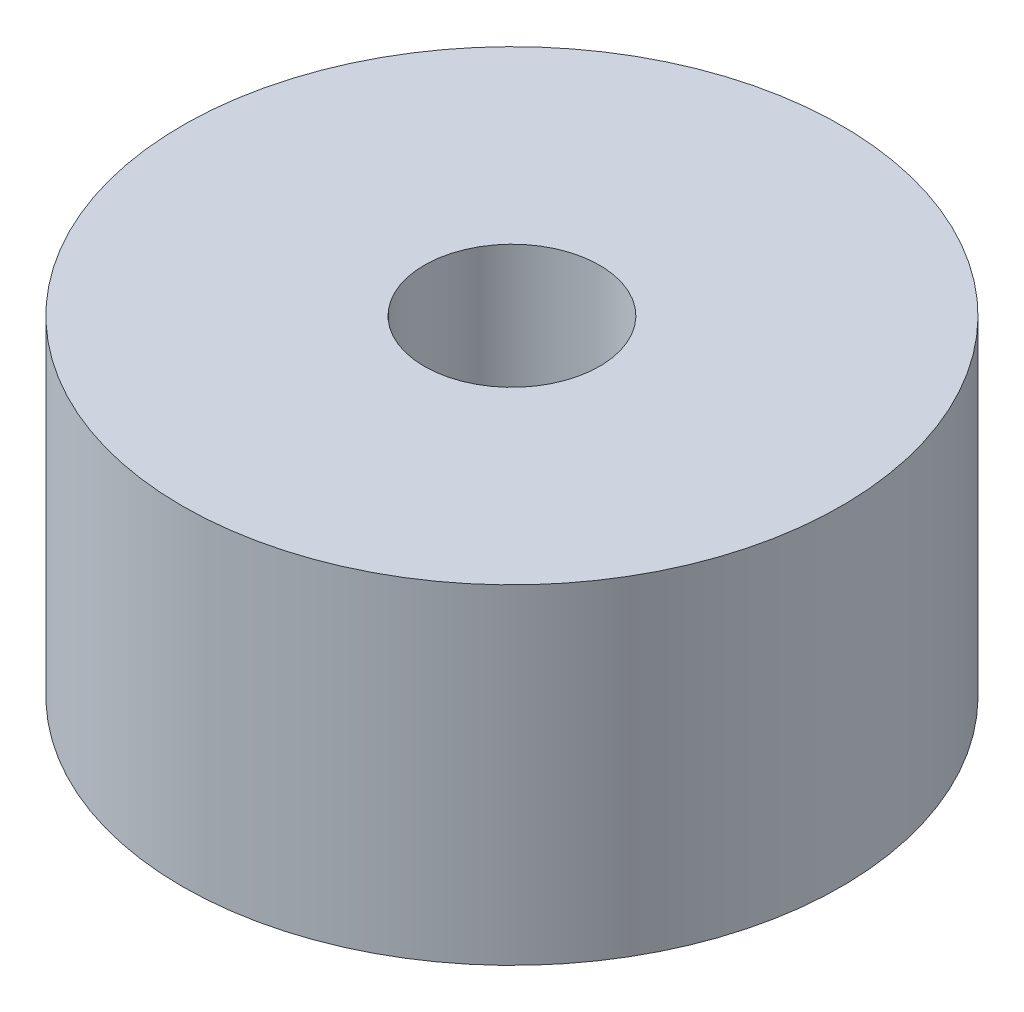
ISO-10303-21;
HEADER;
FILE_DESCRIPTION(('STEP AP214'),'2;1');
FILE_NAME('part.step','',(''),(''),'','','');
FILE_SCHEMA(('AUTOMOTIVE_DESIGN { 1 0 10303 214 1 1 1 1 }'));
ENDSEC;
DATA;
#1=APPLICATION_CONTEXT('core data for automotive mechanical design processes');
#2=APPLICATION_PROTOCOL_DEFINITION('international standard','automotive_design',2000,#1);
#3=PRODUCT_CONTEXT('',#1,'mechanical');
#4=PRODUCT('Part','Part','',(#3));
#5=PRODUCT_RELATED_PRODUCT_CATEGORY('part','',(#4));
#6=PRODUCT_DEFINITION_FORMATION('','',#4);
#7=PRODUCT_DEFINITION_CONTEXT('part definition',#1,'design');
#8=PRODUCT_DEFINITION('design','',#6,#7);
#9=PRODUCT_DEFINITION_SHAPE('','',#8);
#10=(LENGTH_UNIT() NAMED_UNIT(*) SI_UNIT(.MILLI.,.METRE.));
#11=(NAMED_UNIT(*) PLANE_ANGLE_UNIT() SI_UNIT($,.RADIAN.));
#12=(NAMED_UNIT(*) SI_UNIT($,.STERADIAN.) SOLID_ANGLE_UNIT());
#13=UNCERTAINTY_MEASURE_WITH_UNIT(LENGTH_MEASURE(1.E-05),#10,'distance_accuracy_value','');
#14=(GEOMETRIC_REPRESENTATION_CONTEXT(3) GLOBAL_UNCERTAINTY_ASSIGNED_CONTEXT((#13)) GLOBAL_UNIT_ASSIGNED_CONTEXT((#10,
#11,#12)) REPRESENTATION_CONTEXT('',''));
#15=CARTESIAN_POINT('',(0.,0.,0.));
#16=DIRECTION('',(0.,0.,1.));
#17=DIRECTION('',(1.,0.,0.));
#18=AXIS2_PLACEMENT_3D('',#15,#16,#17);
#19=CARTESIAN_POINT('',(0.,6.35,0.));
#20=DIRECTION('',(0.,1.,0.));
#21=DIRECTION('',(0.,0.,1.));
#22=AXIS2_PLACEMENT_3D('',#19,#20,#21);
#23=PLANE('',#22);
#24=CARTESIAN_POINT('',(0.,6.35,0.));
#25=DIRECTION('',(0.,1.,0.));
#26=DIRECTION('',(0.,0.,1.));
#27=AXIS2_PLACEMENT_3D('',#24,#25,#26);
#28=CIRCLE('',#27,6.35);
#29=CARTESIAN_POINT('',(0.,6.35,6.35));
#30=VERTEX_POINT('',#29);
#31=EDGE_CURVE('E10',#30,#30,#28,.T.);
#32=ORIENTED_EDGE('',*,*,#31,.T.);
#33=EDGE_LOOP('',(#32));
#34=FACE_BOUND('',#33,.T.);
#35=CARTESIAN_POINT('',(0.,6.35,0.));
#36=DIRECTION('',(0.,1.,0.));
#37=DIRECTION('',(0.,0.,1.));
#38=AXIS2_PLACEMENT_3D('',#35,#36,#37);
#39=CIRCLE('',#38,1.6891);
#40=CARTESIAN_POINT('',(0.,6.35,1.6891));
#41=VERTEX_POINT('',#40);
#42=EDGE_CURVE('E50',#41,#41,#39,.T.);
#43=ORIENTED_EDGE('',*,*,#42,.F.);
#44=EDGE_LOOP('',(#43));
#45=FACE_BOUND('',#44,.T.);
#46=ADVANCED_FACE('F37',(#34,#45),#23,.T.);
#47=CARTESIAN_POINT('',(0.,0.,0.));
#48=DIRECTION('',(0.,1.,0.));
#49=DIRECTION('',(0.,0.,1.));
#50=AXIS2_PLACEMENT_3D('',#47,#48,#49);
#51=PLANE('',#50);
#52=CARTESIAN_POINT('',(0.,0.,0.));
#53=DIRECTION('',(0.,1.,0.));
#54=DIRECTION('',(0.,0.,1.));
#55=AXIS2_PLACEMENT_3D('',#52,#53,#54);
#56=CIRCLE('',#55,6.35);
#57=CARTESIAN_POINT('',(0.,0.,6.35));
#58=VERTEX_POINT('',#57);
#59=EDGE_CURVE('E41',#58,#58,#56,.T.);
#60=ORIENTED_EDGE('',*,*,#59,.F.);
#61=EDGE_LOOP('',(#60));
#62=FACE_BOUND('',#61,.T.);
#63=CARTESIAN_POINT('',(0.,0.,0.));
#64=DIRECTION('',(0.,1.,0.));
#65=DIRECTION('',(0.,0.,1.));
#66=AXIS2_PLACEMENT_3D('',#63,#64,#65);
#67=CIRCLE('',#66,1.6891);
#68=CARTESIAN_POINT('',(0.,0.,1.6891));
#69=VERTEX_POINT('',#68);
#70=EDGE_CURVE('E52',#69,#69,#67,.T.);
#71=ORIENTED_EDGE('',*,*,#70,.T.);
#72=EDGE_LOOP('',(#71));
#73=FACE_BOUND('',#72,.T.);
#74=ADVANCED_FACE('F64',(#62,#73),#51,.F.);
#75=CARTESIAN_POINT('',(0.,6.35,0.));
#76=DIRECTION('',(0.,-1.,0.));
#77=DIRECTION('',(0.,0.,-1.));
#78=AXIS2_PLACEMENT_3D('',#75,#76,#77);
#79=CYLINDRICAL_SURFACE('',#78,6.35);
#80=ORIENTED_EDGE('',*,*,#31,.F.);
#81=EDGE_LOOP('',(#80));
#82=FACE_BOUND('',#81,.T.);
#83=ORIENTED_EDGE('',*,*,#59,.T.);
#84=EDGE_LOOP('',(#83));
#85=FACE_BOUND('',#84,.T.);
#86=ADVANCED_FACE('F39',(#82,#85),#79,.T.);
#87=CARTESIAN_POINT('',(0.,6.35,0.));
#88=DIRECTION('',(0.,-1.,0.));
#89=DIRECTION('',(0.,0.,-1.));
#90=AXIS2_PLACEMENT_3D('',#87,#88,#89);
#91=CYLINDRICAL_SURFACE('',#90,1.6891);
#92=ORIENTED_EDGE('',*,*,#42,.T.);
#93=EDGE_LOOP('',(#92));
#94=FACE_BOUND('',#93,.T.);
#95=ORIENTED_EDGE('',*,*,#70,.F.);
#96=EDGE_LOOP('',(#95));
#97=FACE_BOUND('',#96,.T.);
#98=ADVANCED_FACE('F60',(#94,#97),#91,.F.);
#99=CLOSED_SHELL('',(#46,#74,#86,#98));
#100=MANIFOLD_SOLID_BREP('B2',#99);
#101=ADVANCED_BREP_SHAPE_REPRESENTATION('',(#18,#100),#14);
#102=SHAPE_DEFINITION_REPRESENTATION(#9,#101);
ENDSEC;
END-ISO-10303-21;
